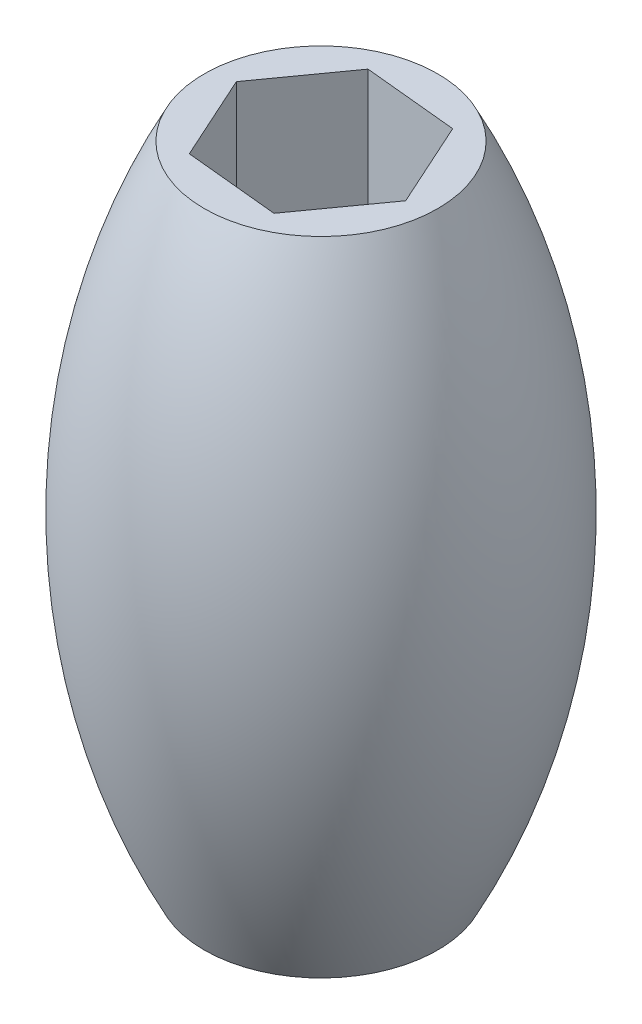
ISO-10303-21;
HEADER;
FILE_DESCRIPTION(('STEP AP214'),'2;1');
FILE_NAME('part.step','',(''),(''),'','','');
FILE_SCHEMA(('AUTOMOTIVE_DESIGN { 1 0 10303 214 1 1 1 1 }'));
ENDSEC;
DATA;
#1=APPLICATION_CONTEXT('core data for automotive mechanical design processes');
#2=APPLICATION_PROTOCOL_DEFINITION('international standard','automotive_design',2000,#1);
#3=PRODUCT_CONTEXT('',#1,'mechanical');
#4=PRODUCT('Part','Part','',(#3));
#5=PRODUCT_RELATED_PRODUCT_CATEGORY('part','',(#4));
#6=PRODUCT_DEFINITION_FORMATION('','',#4);
#7=PRODUCT_DEFINITION_CONTEXT('part definition',#1,'design');
#8=PRODUCT_DEFINITION('design','',#6,#7);
#9=PRODUCT_DEFINITION_SHAPE('','',#8);
#10=(LENGTH_UNIT() NAMED_UNIT(*) SI_UNIT(.MILLI.,.METRE.));
#11=(NAMED_UNIT(*) PLANE_ANGLE_UNIT() SI_UNIT($,.RADIAN.));
#12=(NAMED_UNIT(*) SI_UNIT($,.STERADIAN.) SOLID_ANGLE_UNIT());
#13=UNCERTAINTY_MEASURE_WITH_UNIT(LENGTH_MEASURE(1.E-05),#10,'distance_accuracy_value','');
#14=(GEOMETRIC_REPRESENTATION_CONTEXT(3) GLOBAL_UNCERTAINTY_ASSIGNED_CONTEXT((#13)) GLOBAL_UNIT_ASSIGNED_CONTEXT((#10,
#11,#12)) REPRESENTATION_CONTEXT('',''));
#15=CARTESIAN_POINT('',(0.,0.,0.));
#16=DIRECTION('',(0.,0.,1.));
#17=DIRECTION('',(1.,0.,0.));
#18=AXIS2_PLACEMENT_3D('',#15,#16,#17);
#19=CARTESIAN_POINT('',(0.,104.775,0.));
#20=DIRECTION('',(0.,1.,0.));
#21=DIRECTION('',(0.,0.,1.));
#22=AXIS2_PLACEMENT_3D('',#19,#20,#21);
#23=PLANE('',#22);
#24=DIRECTION('',(0.582558314438273,0.,-0.812788908806486));
#25=VECTOR('',#24,1.);
#26=CARTESIAN_POINT('',(-15.3236366613952,104.775,-1.510781079292));
#27=LINE('',#26,#25);
#28=CARTESIAN_POINT('',(-15.3236366613952,104.775,-1.510781079292));
#29=VERTEX_POINT('',#28);
#30=CARTESIAN_POINT('',(-6.35344353647385,104.775,-14.0260491667768));
#31=VERTEX_POINT('',#30);
#32=EDGE_CURVE('E107',#29,#31,#27,.T.);
#33=ORIENTED_EDGE('',*,*,#32,.T.);
#34=DIRECTION('',(0.995175000159787,0.,0.0981158450861447));
#35=VECTOR('',#34,1.);
#36=CARTESIAN_POINT('',(-6.35344353647385,104.775,-14.0260491667768));
#37=LINE('',#36,#35);
#38=CARTESIAN_POINT('',(8.97019312492135,104.775,-12.5152680874848));
#39=VERTEX_POINT('',#38);
#40=EDGE_CURVE('E93',#31,#39,#37,.T.);
#41=ORIENTED_EDGE('',*,*,#40,.T.);
#42=DIRECTION('',(0.412616685721513,0.,0.910904753892631));
#43=VECTOR('',#42,1.);
#44=CARTESIAN_POINT('',(8.97019312492135,104.775,-12.5152680874848));
#45=LINE('',#44,#43);
#46=CARTESIAN_POINT('',(15.3236366613952,104.775,1.510781079292));
#47=VERTEX_POINT('',#46);
#48=EDGE_CURVE('E138',#39,#47,#45,.T.);
#49=ORIENTED_EDGE('',*,*,#48,.T.);
#50=DIRECTION('',(-0.582558314438273,0.,0.812788908806486));
#51=VECTOR('',#50,1.);
#52=CARTESIAN_POINT('',(15.3236366613952,104.775,1.510781079292));
#53=LINE('',#52,#51);
#54=CARTESIAN_POINT('',(6.35344353647386,104.775,14.0260491667768));
#55=VERTEX_POINT('',#54);
#56=EDGE_CURVE('E133',#47,#55,#53,.T.);
#57=ORIENTED_EDGE('',*,*,#56,.T.);
#58=DIRECTION('',(-0.995175000159787,0.,-0.0981158450861446));
#59=VECTOR('',#58,1.);
#60=CARTESIAN_POINT('',(6.35344353647386,104.775,14.0260491667768));
#61=LINE('',#60,#59);
#62=CARTESIAN_POINT('',(-8.97019312492135,104.775,12.5152680874848));
#63=VERTEX_POINT('',#62);
#64=EDGE_CURVE('E129',#55,#63,#61,.T.);
#65=ORIENTED_EDGE('',*,*,#64,.T.);
#66=DIRECTION('',(-0.412616685721514,0.,-0.91090475389263));
#67=VECTOR('',#66,1.);
#68=CARTESIAN_POINT('',(-8.97019312492135,104.775,12.5152680874848));
#69=LINE('',#68,#67);
#70=EDGE_CURVE('E116',#63,#29,#69,.T.);
#71=ORIENTED_EDGE('',*,*,#70,.T.);
#72=EDGE_LOOP('',(#33,#41,#49,#57,#65,#71));
#73=FACE_BOUND('',#72,.T.);
#74=CARTESIAN_POINT('',(0.,104.775,0.));
#75=DIRECTION('',(0.,-1.,0.));
#76=DIRECTION('',(1.,0.,0.));
#77=AXIS2_PLACEMENT_3D('',#74,#75,#76);
#78=CIRCLE('',#77,19.05);
#79=CARTESIAN_POINT('',(19.05,104.775,0.));
#80=VERTEX_POINT('',#79);
#81=EDGE_CURVE('E153',#80,#80,#78,.T.);
#82=ORIENTED_EDGE('',*,*,#81,.F.);
#83=EDGE_LOOP('',(#82));
#84=FACE_BOUND('',#83,.T.);
#85=ADVANCED_FACE('F39',(#73,#84),#23,.T.);
#86=CARTESIAN_POINT('',(0.,0.,0.));
#87=DIRECTION('',(0.,1.,0.));
#88=DIRECTION('',(0.,0.,1.));
#89=AXIS2_PLACEMENT_3D('',#86,#87,#88);
#90=PLANE('',#89);
#91=DIRECTION('',(0.995175000159787,0.,0.0981158450861447));
#92=VECTOR('',#91,1.);
#93=CARTESIAN_POINT('',(-6.35344353647385,0.,-14.0260491667768));
#94=LINE('',#93,#92);
#95=CARTESIAN_POINT('',(-6.35344353647385,0.,-14.0260491667768));
#96=VERTEX_POINT('',#95);
#97=CARTESIAN_POINT('',(8.97019312492135,0.,-12.5152680874848));
#98=VERTEX_POINT('',#97);
#99=EDGE_CURVE('E156',#96,#98,#94,.T.);
#100=ORIENTED_EDGE('',*,*,#99,.F.);
#101=DIRECTION('',(0.582558314438273,0.,-0.812788908806486));
#102=VECTOR('',#101,1.);
#103=CARTESIAN_POINT('',(-15.3236366613952,0.,-1.510781079292));
#104=LINE('',#103,#102);
#105=CARTESIAN_POINT('',(-15.3236366613952,0.,-1.510781079292));
#106=VERTEX_POINT('',#105);
#107=EDGE_CURVE('E110',#106,#96,#104,.T.);
#108=ORIENTED_EDGE('',*,*,#107,.F.);
#109=DIRECTION('',(-0.412616685721513,0.,-0.91090475389263));
#110=VECTOR('',#109,1.);
#111=CARTESIAN_POINT('',(-8.97019312492135,0.,12.5152680874848));
#112=LINE('',#111,#110);
#113=CARTESIAN_POINT('',(-8.97019312492135,0.,12.5152680874848));
#114=VERTEX_POINT('',#113);
#115=EDGE_CURVE('E124',#114,#106,#112,.T.);
#116=ORIENTED_EDGE('',*,*,#115,.F.);
#117=DIRECTION('',(-0.995175000159787,0.,-0.0981158450861446));
#118=VECTOR('',#117,1.);
#119=CARTESIAN_POINT('',(6.35344353647386,0.,14.0260491667768));
#120=LINE('',#119,#118);
#121=CARTESIAN_POINT('',(6.35344353647386,0.,14.0260491667768));
#122=VERTEX_POINT('',#121);
#123=EDGE_CURVE('E62',#122,#114,#120,.T.);
#124=ORIENTED_EDGE('',*,*,#123,.F.);
#125=DIRECTION('',(-0.582558314438273,0.,0.812788908806486));
#126=VECTOR('',#125,1.);
#127=CARTESIAN_POINT('',(15.3236366613952,0.,1.510781079292));
#128=LINE('',#127,#126);
#129=CARTESIAN_POINT('',(15.3236366613952,0.,1.510781079292));
#130=VERTEX_POINT('',#129);
#131=EDGE_CURVE('E120',#130,#122,#128,.T.);
#132=ORIENTED_EDGE('',*,*,#131,.F.);
#133=DIRECTION('',(0.412616685721513,0.,0.91090475389263));
#134=VECTOR('',#133,1.);
#135=CARTESIAN_POINT('',(8.97019312492135,0.,-12.5152680874848));
#136=LINE('',#135,#134);
#137=EDGE_CURVE('E159',#98,#130,#136,.T.);
#138=ORIENTED_EDGE('',*,*,#137,.F.);
#139=EDGE_LOOP('',(#100,#108,#116,#124,#132,#138));
#140=FACE_BOUND('',#139,.T.);
#141=CARTESIAN_POINT('',(0.,0.,0.));
#142=DIRECTION('',(0.,1.,0.));
#143=DIRECTION('',(0.,0.,1.));
#144=AXIS2_PLACEMENT_3D('',#141,#142,#143);
#145=CIRCLE('',#144,19.05);
#146=CARTESIAN_POINT('',(0.,0.,19.05));
#147=VERTEX_POINT('',#146);
#148=EDGE_CURVE('E11',#147,#147,#145,.T.);
#149=ORIENTED_EDGE('',*,*,#148,.F.);
#150=EDGE_LOOP('',(#149));
#151=FACE_BOUND('',#150,.T.);
#152=ADVANCED_FACE('F41',(#140,#151),#90,.F.);
#153=CARTESIAN_POINT('',(-15.3236366613952,146.322269260893,-1.510781079292));
#154=DIRECTION('',(-0.812788908806486,0.,-0.582558314438273));
#155=DIRECTION('',(-0.582558314438273,0.,0.812788908806486));
#156=AXIS2_PLACEMENT_3D('',#153,#154,#155);
#157=PLANE('',#156);
#158=DIRECTION('',(0.,-1.,0.));
#159=VECTOR('',#158,1.);
#160=CARTESIAN_POINT('',(-15.3236366613952,146.322269260893,-1.510781079292));
#161=LINE('',#160,#159);
#162=EDGE_CURVE('E48',#29,#106,#161,.T.);
#163=ORIENTED_EDGE('',*,*,#162,.T.);
#164=ORIENTED_EDGE('',*,*,#107,.T.);
#165=DIRECTION('',(0.,-1.,0.));
#166=VECTOR('',#165,1.);
#167=CARTESIAN_POINT('',(-6.35344353647385,146.322269260893,-14.0260491667768));
#168=LINE('',#167,#166);
#169=EDGE_CURVE('E97',#31,#96,#168,.T.);
#170=ORIENTED_EDGE('',*,*,#169,.F.);
#171=ORIENTED_EDGE('',*,*,#32,.F.);
#172=EDGE_LOOP('',(#163,#164,#170,#171));
#173=FACE_BOUND('',#172,.T.);
#174=ADVANCED_FACE('F106',(#173),#157,.F.);
#175=CARTESIAN_POINT('',(-6.35344353647385,146.322269260893,-14.0260491667768));
#176=DIRECTION('',(0.0981158450861447,0.,-0.995175000159787));
#177=DIRECTION('',(-0.995175000159787,0.,-0.0981158450861447));
#178=AXIS2_PLACEMENT_3D('',#175,#176,#177);
#179=PLANE('',#178);
#180=ORIENTED_EDGE('',*,*,#169,.T.);
#181=ORIENTED_EDGE('',*,*,#99,.T.);
#182=DIRECTION('',(0.,-1.,0.));
#183=VECTOR('',#182,1.);
#184=CARTESIAN_POINT('',(8.97019312492135,146.322269260893,-12.5152680874848));
#185=LINE('',#184,#183);
#186=EDGE_CURVE('E99',#39,#98,#185,.T.);
#187=ORIENTED_EDGE('',*,*,#186,.F.);
#188=ORIENTED_EDGE('',*,*,#40,.F.);
#189=EDGE_LOOP('',(#180,#181,#187,#188));
#190=FACE_BOUND('',#189,.T.);
#191=ADVANCED_FACE('F95',(#190),#179,.F.);
#192=CARTESIAN_POINT('',(8.97019312492135,146.322269260893,-12.5152680874848));
#193=DIRECTION('',(0.910904753892631,0.,-0.412616685721513));
#194=DIRECTION('',(-0.412616685721513,0.,-0.910904753892631));
#195=AXIS2_PLACEMENT_3D('',#192,#193,#194);
#196=PLANE('',#195);
#197=ORIENTED_EDGE('',*,*,#186,.T.);
#198=ORIENTED_EDGE('',*,*,#137,.T.);
#199=DIRECTION('',(0.,-1.,0.));
#200=VECTOR('',#199,1.);
#201=CARTESIAN_POINT('',(15.3236366613952,146.322269260893,1.510781079292));
#202=LINE('',#201,#200);
#203=EDGE_CURVE('E137',#47,#130,#202,.T.);
#204=ORIENTED_EDGE('',*,*,#203,.F.);
#205=ORIENTED_EDGE('',*,*,#48,.F.);
#206=EDGE_LOOP('',(#197,#198,#204,#205));
#207=FACE_BOUND('',#206,.T.);
#208=ADVANCED_FACE('F182',(#207),#196,.F.);
#209=CARTESIAN_POINT('',(15.3236366613952,146.322269260893,1.510781079292));
#210=DIRECTION('',(0.812788908806486,0.,0.582558314438273));
#211=DIRECTION('',(0.582558314438273,0.,-0.812788908806486));
#212=AXIS2_PLACEMENT_3D('',#209,#210,#211);
#213=PLANE('',#212);
#214=ORIENTED_EDGE('',*,*,#203,.T.);
#215=ORIENTED_EDGE('',*,*,#131,.T.);
#216=DIRECTION('',(0.,-1.,0.));
#217=VECTOR('',#216,1.);
#218=CARTESIAN_POINT('',(6.35344353647386,146.322269260893,14.0260491667768));
#219=LINE('',#218,#217);
#220=EDGE_CURVE('E132',#55,#122,#219,.T.);
#221=ORIENTED_EDGE('',*,*,#220,.F.);
#222=ORIENTED_EDGE('',*,*,#56,.F.);
#223=EDGE_LOOP('',(#214,#215,#221,#222));
#224=FACE_BOUND('',#223,.T.);
#225=ADVANCED_FACE('F185',(#224),#213,.F.);
#226=CARTESIAN_POINT('',(6.35344353647386,146.322269260893,14.0260491667768));
#227=DIRECTION('',(-0.0981158450861446,0.,0.995175000159787));
#228=DIRECTION('',(0.995175000159787,0.,0.0981158450861446));
#229=AXIS2_PLACEMENT_3D('',#226,#227,#228);
#230=PLANE('',#229);
#231=ORIENTED_EDGE('',*,*,#220,.T.);
#232=ORIENTED_EDGE('',*,*,#123,.T.);
#233=DIRECTION('',(0.,-1.,0.));
#234=VECTOR('',#233,1.);
#235=CARTESIAN_POINT('',(-8.97019312492135,146.322269260893,12.5152680874848));
#236=LINE('',#235,#234);
#237=EDGE_CURVE('E128',#63,#114,#236,.T.);
#238=ORIENTED_EDGE('',*,*,#237,.F.);
#239=ORIENTED_EDGE('',*,*,#64,.F.);
#240=EDGE_LOOP('',(#231,#232,#238,#239));
#241=FACE_BOUND('',#240,.T.);
#242=ADVANCED_FACE('F189',(#241),#230,.F.);
#243=CARTESIAN_POINT('',(-8.97019312492135,146.322269260893,12.5152680874848));
#244=DIRECTION('',(-0.91090475389263,0.,0.412616685721514));
#245=DIRECTION('',(0.412616685721514,0.,0.91090475389263));
#246=AXIS2_PLACEMENT_3D('',#243,#244,#245);
#247=PLANE('',#246);
#248=ORIENTED_EDGE('',*,*,#237,.T.);
#249=ORIENTED_EDGE('',*,*,#115,.T.);
#250=ORIENTED_EDGE('',*,*,#162,.F.);
#251=ORIENTED_EDGE('',*,*,#70,.F.);
#252=EDGE_LOOP('',(#248,#249,#250,#251));
#253=FACE_BOUND('',#252,.T.);
#254=ADVANCED_FACE('F150',(#253),#247,.F.);
#255=CARTESIAN_POINT('',(0.,52.3875,0.));
#256=DIRECTION('',(0.,-1.,0.));
#257=DIRECTION('',(1.,0.,0.));
#258=AXIS2_PLACEMENT_3D('',#255,#256,#257);
#259=DEGENERATE_TOROIDAL_SURFACE('',#258,82.6492187500001,114.39921875,.F.);
#260=ORIENTED_EDGE('',*,*,#148,.T.);
#261=EDGE_LOOP('',(#260));
#262=FACE_BOUND('',#261,.T.);
#263=ORIENTED_EDGE('',*,*,#81,.T.);
#264=EDGE_LOOP('',(#263));
#265=FACE_BOUND('',#264,.T.);
#266=ADVANCED_FACE('F172',(#262,#265),#259,.F.);
#267=CLOSED_SHELL('',(#85,#152,#174,#191,#208,#225,#242,#254,#266));
#268=MANIFOLD_SOLID_BREP('B2',#267);
#269=ADVANCED_BREP_SHAPE_REPRESENTATION('',(#18,#268),#14);
#270=SHAPE_DEFINITION_REPRESENTATION(#9,#269);
ENDSEC;
END-ISO-10303-21;
